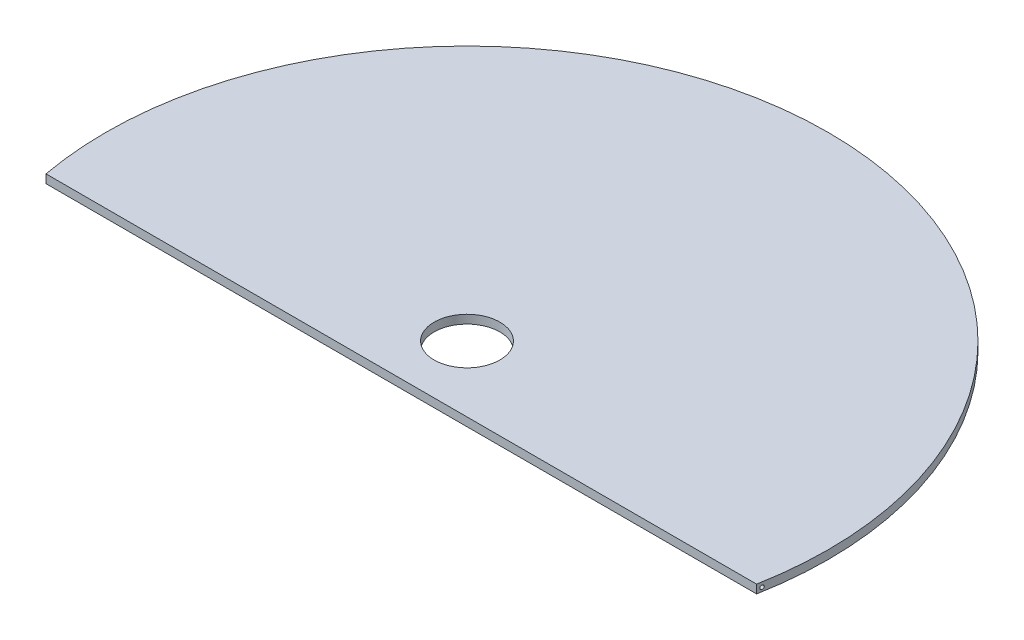
ISO-10303-21;
HEADER;
FILE_DESCRIPTION(('STEP AP214'),'2;1');
FILE_NAME('part.step','',(''),(''),'','','');
FILE_SCHEMA(('AUTOMOTIVE_DESIGN { 1 0 10303 214 1 1 1 1 }'));
ENDSEC;
DATA;
#1=APPLICATION_CONTEXT('core data for automotive mechanical design processes');
#2=APPLICATION_PROTOCOL_DEFINITION('international standard','automotive_design',2000,#1);
#3=PRODUCT_CONTEXT('',#1,'mechanical');
#4=PRODUCT('Part','Part','',(#3));
#5=PRODUCT_RELATED_PRODUCT_CATEGORY('part','',(#4));
#6=PRODUCT_DEFINITION_FORMATION('','',#4);
#7=PRODUCT_DEFINITION_CONTEXT('part definition',#1,'design');
#8=PRODUCT_DEFINITION('design','',#6,#7);
#9=PRODUCT_DEFINITION_SHAPE('','',#8);
#10=(LENGTH_UNIT() NAMED_UNIT(*) SI_UNIT(.MILLI.,.METRE.));
#11=(NAMED_UNIT(*) PLANE_ANGLE_UNIT() SI_UNIT($,.RADIAN.));
#12=(NAMED_UNIT(*) SI_UNIT($,.STERADIAN.) SOLID_ANGLE_UNIT());
#13=UNCERTAINTY_MEASURE_WITH_UNIT(LENGTH_MEASURE(1.E-05),#10,'distance_accuracy_value','');
#14=(GEOMETRIC_REPRESENTATION_CONTEXT(3) GLOBAL_UNCERTAINTY_ASSIGNED_CONTEXT((#13)) GLOBAL_UNIT_ASSIGNED_CONTEXT((#10,
#11,#12)) REPRESENTATION_CONTEXT('',''));
#15=CARTESIAN_POINT('',(0.,0.,0.));
#16=DIRECTION('',(0.,0.,1.));
#17=DIRECTION('',(1.,0.,0.));
#18=AXIS2_PLACEMENT_3D('',#15,#16,#17);
#19=CARTESIAN_POINT('',(0.,3.302,25.4));
#20=DIRECTION('',(0.,0.,-1.));
#21=DIRECTION('',(-1.,0.,0.));
#22=AXIS2_PLACEMENT_3D('',#19,#20,#21);
#23=PLANE('',#22);
#24=DIRECTION('',(1.,0.,0.));
#25=VECTOR('',#24,1.);
#26=CARTESIAN_POINT('',(0.,0.,25.4));
#27=LINE('',#26,#25);
#28=CARTESIAN_POINT('',(-137.371503595178,0.,25.4));
#29=VERTEX_POINT('',#28);
#30=CARTESIAN_POINT('',(137.371503595178,0.,25.4));
#31=VERTEX_POINT('',#30);
#32=EDGE_CURVE('E73',#29,#31,#27,.T.);
#33=ORIENTED_EDGE('',*,*,#32,.T.);
#34=DIRECTION('',(0.,-1.,0.));
#35=VECTOR('',#34,1.);
#36=CARTESIAN_POINT('',(137.371503595178,3.302,25.4));
#37=LINE('',#36,#35);
#38=CARTESIAN_POINT('',(137.371503595178,3.302,25.4));
#39=VERTEX_POINT('',#38);
#40=EDGE_CURVE('E11',#39,#31,#37,.T.);
#41=ORIENTED_EDGE('',*,*,#40,.F.);
#42=DIRECTION('',(1.,0.,0.));
#43=VECTOR('',#42,1.);
#44=CARTESIAN_POINT('',(0.,3.302,25.4));
#45=LINE('',#44,#43);
#46=CARTESIAN_POINT('',(-137.371503595178,3.302,25.4));
#47=VERTEX_POINT('',#46);
#48=EDGE_CURVE('E76',#47,#39,#45,.T.);
#49=ORIENTED_EDGE('',*,*,#48,.F.);
#50=DIRECTION('',(0.,-1.,0.));
#51=VECTOR('',#50,1.);
#52=CARTESIAN_POINT('',(-137.371503595178,3.302,25.4));
#53=LINE('',#52,#51);
#54=EDGE_CURVE('E49',#47,#29,#53,.T.);
#55=ORIENTED_EDGE('',*,*,#54,.T.);
#56=EDGE_LOOP('',(#33,#41,#49,#55));
#57=FACE_BOUND('',#56,.T.);
#58=ADVANCED_FACE('F35',(#57),#23,.F.);
#59=CARTESIAN_POINT('',(0.,3.302,0.));
#60=DIRECTION('',(0.,-1.,0.));
#61=DIRECTION('',(0.,0.,-1.));
#62=AXIS2_PLACEMENT_3D('',#59,#60,#61);
#63=CYLINDRICAL_SURFACE('',#62,12.7);
#64=CARTESIAN_POINT('',(0.,3.302,0.));
#65=DIRECTION('',(0.,1.,0.));
#66=DIRECTION('',(0.,0.,1.));
#67=AXIS2_PLACEMENT_3D('',#64,#65,#66);
#68=CIRCLE('',#67,12.7);
#69=CARTESIAN_POINT('',(0.,3.302,12.7));
#70=VERTEX_POINT('',#69);
#71=EDGE_CURVE('E72',#70,#70,#68,.T.);
#72=ORIENTED_EDGE('',*,*,#71,.T.);
#73=EDGE_LOOP('',(#72));
#74=FACE_BOUND('',#73,.T.);
#75=CARTESIAN_POINT('',(0.,0.,0.));
#76=DIRECTION('',(0.,1.,0.));
#77=DIRECTION('',(0.,0.,1.));
#78=AXIS2_PLACEMENT_3D('',#75,#76,#77);
#79=CIRCLE('',#78,12.7);
#80=CARTESIAN_POINT('',(0.,0.,12.7));
#81=VERTEX_POINT('',#80);
#82=EDGE_CURVE('E79',#81,#81,#79,.T.);
#83=ORIENTED_EDGE('',*,*,#82,.F.);
#84=EDGE_LOOP('',(#83));
#85=FACE_BOUND('',#84,.T.);
#86=ADVANCED_FACE('F37',(#74,#85),#63,.F.);
#87=CARTESIAN_POINT('',(0.,3.302,0.));
#88=DIRECTION('',(0.,-1.,0.));
#89=DIRECTION('',(0.,0.,-1.));
#90=AXIS2_PLACEMENT_3D('',#87,#88,#89);
#91=CYLINDRICAL_SURFACE('',#90,139.7);
#92=CARTESIAN_POINT('',(-137.814088901934,1.524,22.8772135569419));
#93=CARTESIAN_POINT('',(-137.814088602734,1.56541229015592,22.877215461518));
#94=CARTESIAN_POINT('',(-137.813513624116,1.60685489980099,22.8806799107889));
#95=CARTESIAN_POINT('',(-137.811227744358,1.68859140060342,22.8944437436117));
#96=CARTESIAN_POINT('',(-137.809515470055,1.72888384164274,22.9047513895882));
#97=CARTESIAN_POINT('',(-137.805003605925,1.80711612692118,22.9318810621751));
#98=CARTESIAN_POINT('',(-137.802204838894,1.8450577262873,22.9486981591839));
#99=CARTESIAN_POINT('',(-137.795597988017,1.91755182448106,22.9883356695262));
#100=CARTESIAN_POINT('',(-137.791790131559,1.95210508443472,23.0111547303722));
#101=CARTESIAN_POINT('',(-137.78324312594,2.01708744886675,23.0622762806492));
#102=CARTESIAN_POINT('',(-137.778498597835,2.04749093175989,23.0906104272114));
#103=CARTESIAN_POINT('',(-137.768221093349,2.10311892189644,23.1518513090451));
#104=CARTESIAN_POINT('',(-137.762688040892,2.12834292885472,23.1847584855107));
#105=CARTESIAN_POINT('',(-137.750906121703,2.17324133938305,23.2546583041101));
#106=CARTESIAN_POINT('',(-137.744648985501,2.19284042872746,23.2916979254072));
#107=CARTESIAN_POINT('',(-137.731646895851,2.22554517001531,23.368460748667));
#108=CARTESIAN_POINT('',(-137.724901907864,2.23865036169288,23.4081841406197));
#109=CARTESIAN_POINT('',(-137.711017517757,2.25816011384876,23.4897293567195));
#110=CARTESIAN_POINT('',(-137.703874181362,2.2644770482989,23.5315714879941));
#111=CARTESIAN_POINT('',(-137.689470999952,2.2699520390152,23.6157023445996));
#112=CARTESIAN_POINT('',(-137.682211149111,2.26910973607268,23.6579910922328));
#113=CARTESIAN_POINT('',(-137.66772542279,2.26025806070488,23.7421400251758));
#114=CARTESIAN_POINT('',(-137.6605001795,2.25219655218458,23.7839948486633));
#115=CARTESIAN_POINT('',(-137.646346992319,2.22904588615588,23.8657680081781));
#116=CARTESIAN_POINT('',(-137.639419050781,2.21395667303788,23.9056863288792));
#117=CARTESIAN_POINT('',(-137.626078917368,2.17718256455738,23.9823667568922));
#118=CARTESIAN_POINT('',(-137.619665839752,2.15550931731716,24.019134292305));
#119=CARTESIAN_POINT('',(-137.607539727578,2.10614143192906,24.088508713765));
#120=CARTESIAN_POINT('',(-137.601826658777,2.07844708850326,24.1211158033349));
#121=CARTESIAN_POINT('',(-137.59133934309,2.0181249917138,24.1808653767689));
#122=CARTESIAN_POINT('',(-137.586555816136,1.98555244499801,24.2080619493794));
#123=CARTESIAN_POINT('',(-137.578009595423,1.91617466076484,24.2565843597577));
#124=CARTESIAN_POINT('',(-137.574246815699,1.87936978006087,24.2779106919114));
#125=CARTESIAN_POINT('',(-137.567916485798,1.80315758837691,24.3137549905397));
#126=CARTESIAN_POINT('',(-137.565332051123,1.76379692086494,24.3283691595061));
#127=CARTESIAN_POINT('',(-137.561364648943,1.683125244701,24.3507923258079));
#128=CARTESIAN_POINT('',(-137.559981587903,1.64181438814802,24.3586018529292));
#129=CARTESIAN_POINT('',(-137.558473507958,1.55895093085115,24.3671168761356));
#130=CARTESIAN_POINT('',(-137.558333480365,1.51740729225714,24.3679071247684));
#131=CARTESIAN_POINT('',(-137.559276849337,1.43478027041791,24.3625811395361));
#132=CARTESIAN_POINT('',(-137.560360204681,1.39369687171163,24.356465138383));
#133=CARTESIAN_POINT('',(-137.563707724896,1.31330537955675,24.3375513923011));
#134=CARTESIAN_POINT('',(-137.565967660873,1.27399147237238,24.3247775768755));
#135=CARTESIAN_POINT('',(-137.571591359621,1.19807901894383,24.292951866678));
#136=CARTESIAN_POINT('',(-137.57495514671,1.16148053254033,24.2738998336012));
#137=CARTESIAN_POINT('',(-137.582703945973,1.09176995437964,24.2299416908682));
#138=CARTESIAN_POINT('',(-137.587095494618,1.05868223524135,24.2049981016421));
#139=CARTESIAN_POINT('',(-137.596749550455,0.99715735316511,24.1500577478816));
#140=CARTESIAN_POINT('',(-137.602012114107,0.968720491941779,24.1200606557679));
#141=CARTESIAN_POINT('',(-137.613324691219,0.91689255789136,24.0554350579893));
#142=CARTESIAN_POINT('',(-137.619384350884,0.89357455835839,24.0207496448089));
#143=CARTESIAN_POINT('',(-137.632053506769,0.853083993332087,23.9480522715928));
#144=CARTESIAN_POINT('',(-137.638663045093,0.835911898975186,23.910040056807));
#145=CARTESIAN_POINT('',(-137.65233789263,0.807954011711257,23.831187440786));
#146=CARTESIAN_POINT('',(-137.659408337526,0.797262276720684,23.790314567025));
#147=CARTESIAN_POINT('',(-137.673715626853,0.782927380034137,23.7073785139701));
#148=CARTESIAN_POINT('',(-137.680952481235,0.779284640936794,23.6653152634646));
#149=CARTESIAN_POINT('',(-137.695451921803,0.779143938828642,23.5808051929691));
#150=CARTESIAN_POINT('',(-137.702714190048,0.782707981171509,23.5383581990655));
#151=CARTESIAN_POINT('',(-137.716996909315,0.7970174999458,23.4546491312152));
#152=CARTESIAN_POINT('',(-137.724017357027,0.807763074628672,23.4133870734879));
#153=CARTESIAN_POINT('',(-137.737616638179,0.836150471807186,23.3332512729245));
#154=CARTESIAN_POINT('',(-137.744195683889,0.853788951236724,23.2943763828699));
#155=CARTESIAN_POINT('',(-137.756730878267,0.895492855772405,23.2201317129295));
#156=CARTESIAN_POINT('',(-137.762687075876,0.919557775387351,23.1847616576602));
#157=CARTESIAN_POINT('',(-137.773756913172,0.9732063034733,23.1188886727763));
#158=CARTESIAN_POINT('',(-137.77887780573,1.00273705864569,23.0883439278526));
#159=CARTESIAN_POINT('',(-137.788199374711,1.06665058313756,23.03264884366));
#160=CARTESIAN_POINT('',(-137.792399885308,1.10103422496606,23.0074994764891));
#161=CARTESIAN_POINT('',(-137.79971082787,1.17318764050581,22.9636709751561));
#162=CARTESIAN_POINT('',(-137.802834691528,1.21090771209475,22.9449121527964));
#163=CARTESIAN_POINT('',(-137.807975548275,1.28900196966712,22.9140158653081));
#164=CARTESIAN_POINT('',(-137.809993984473,1.32937261786433,22.9018697675494));
#165=CARTESIAN_POINT('',(-137.81231517964,1.39568343160024,22.8878966161835));
#166=CARTESIAN_POINT('',(-137.812979500056,1.4211734696311,22.883895838532));
#167=CARTESIAN_POINT('',(-137.813866452795,1.47243842117016,22.8785537253401));
#168=CARTESIAN_POINT('',(-137.81408908824,1.49821333266302,22.8772123709976));
#169=CARTESIAN_POINT('',(-137.814088901934,1.524,22.8772135569419));
#170=B_SPLINE_CURVE_WITH_KNOTS('',3,(#92,#93,#94,#95,#96,#97,#98,#99,#100,#101,#102,#103,#104,
#105,#106,#107,#108,#109,#110,#111,#112,#113,#114,#115,#116,#117,#118,#119,#120,#121,#122,#123,
#124,#125,#126,#127,#128,#129,#130,#131,#132,#133,#134,#135,#136,#137,#138,#139,#140,#141,#142,
#143,#144,#145,#146,#147,#148,#149,#150,#151,#152,#153,#154,#155,#156,#157,#158,#159,#160,#161,
#162,#163,#164,#165,#166,#167,#168,#169),.UNSPECIFIED.,.T.,.F.,(4,2,2,2,2,2,2,2,2,2,2,2,2,2,2,2,
2,2,2,2,2,2,2,2,2,2,2,2,2,2,2,2,2,2,2,2,2,2,4),(0.,0.124142082302337,0.248434326084497,
0.372632627036189,0.496802964984026,0.621708271289402,0.746625636518215,0.873144899670392,
0.999673128804814,1.12781571818462,1.25596473704859,1.38504676082984,1.51412980604299,
1.6429858013636,1.77183549082915,1.89932402456649,2.02680181805616,2.15239066998675,
2.27796974313224,2.40203045058428,2.52608697783001,2.64970066514507,2.77331707576997,
2.89774213169813,3.02217525624102,3.14828335835745,3.27440112567372,3.40230811132794,
3.53022276497396,3.65924264664658,3.78826429349259,3.91722344221016,4.04617245023996,
4.1739341647369,4.30171887906741,4.42784622730688,4.55380852442893,4.63111005012408,
4.7084110292971),.UNSPECIFIED.);
#171=CARTESIAN_POINT('',(-137.814088901934,1.524,22.8772135569419));
#172=VERTEX_POINT('',#171);
#173=EDGE_CURVE('E39',#172,#172,#170,.T.);
#174=ORIENTED_EDGE('',*,*,#173,.T.);
#175=EDGE_LOOP('',(#174));
#176=FACE_BOUND('',#175,.T.);
#177=CARTESIAN_POINT('',(137.814088901934,1.524,22.8772135569419));
#178=CARTESIAN_POINT('',(137.814088602734,1.48258770984408,22.877215461518));
#179=CARTESIAN_POINT('',(137.813513624116,1.44114510019901,22.8806799107889));
#180=CARTESIAN_POINT('',(137.811227744358,1.35940859939658,22.8944437436117));
#181=CARTESIAN_POINT('',(137.809515470055,1.31911615835725,22.9047513895882));
#182=CARTESIAN_POINT('',(137.805003605925,1.24088387307882,22.9318810621751));
#183=CARTESIAN_POINT('',(137.802204838894,1.2029422737127,22.9486981591839));
#184=CARTESIAN_POINT('',(137.795597988017,1.13044817551894,22.9883356695262));
#185=CARTESIAN_POINT('',(137.791790131559,1.09589491556528,23.0111547303722));
#186=CARTESIAN_POINT('',(137.78324312594,1.03091255113325,23.0622762806492));
#187=CARTESIAN_POINT('',(137.778498597835,1.00050906824011,23.0906104272114));
#188=CARTESIAN_POINT('',(137.768221093349,0.94488107810356,23.1518513090451));
#189=CARTESIAN_POINT('',(137.762688040892,0.919657071145279,23.1847584855107));
#190=CARTESIAN_POINT('',(137.750906121703,0.874758660616954,23.2546583041101));
#191=CARTESIAN_POINT('',(137.744648985501,0.855159571272535,23.2916979254072));
#192=CARTESIAN_POINT('',(137.731646895851,0.822454829984689,23.368460748667));
#193=CARTESIAN_POINT('',(137.724901907864,0.809349638307121,23.4081841406197));
#194=CARTESIAN_POINT('',(137.711017517757,0.789839886151243,23.4897293567195));
#195=CARTESIAN_POINT('',(137.703874181362,0.783522951701104,23.5315714879941));
#196=CARTESIAN_POINT('',(137.689470999952,0.778047960984795,23.6157023445996));
#197=CARTESIAN_POINT('',(137.682211149111,0.778890263927314,23.6579910922328));
#198=CARTESIAN_POINT('',(137.66772542279,0.787741939295116,23.7421400251758));
#199=CARTESIAN_POINT('',(137.6605001795,0.795803447815424,23.7839948486633));
#200=CARTESIAN_POINT('',(137.646346992319,0.818954113844124,23.8657680081781));
#201=CARTESIAN_POINT('',(137.639419050781,0.834043326962116,23.9056863288792));
#202=CARTESIAN_POINT('',(137.626078917368,0.870817435442617,23.9823667568922));
#203=CARTESIAN_POINT('',(137.619665839752,0.89249068268284,24.019134292305));
#204=CARTESIAN_POINT('',(137.607539727578,0.941858568070943,24.088508713765));
#205=CARTESIAN_POINT('',(137.601826658777,0.969552911496744,24.1211158033349));
#206=CARTESIAN_POINT('',(137.59133934309,1.0298750082862,24.1808653767689));
#207=CARTESIAN_POINT('',(137.586555816136,1.06244755500199,24.2080619493794));
#208=CARTESIAN_POINT('',(137.578009595423,1.13182533923516,24.2565843597577));
#209=CARTESIAN_POINT('',(137.574246815699,1.16863021993913,24.2779106919114));
#210=CARTESIAN_POINT('',(137.567916485798,1.24484241162309,24.3137549905397));
#211=CARTESIAN_POINT('',(137.565332051123,1.28420307913506,24.3283691595061));
#212=CARTESIAN_POINT('',(137.561364648943,1.364874755299,24.3507923258079));
#213=CARTESIAN_POINT('',(137.559981587903,1.40618561185198,24.3586018529292));
#214=CARTESIAN_POINT('',(137.558473507958,1.48904906914885,24.3671168761356));
#215=CARTESIAN_POINT('',(137.558333480365,1.53059270774286,24.3679071247684));
#216=CARTESIAN_POINT('',(137.559276849337,1.61321972958209,24.3625811395361));
#217=CARTESIAN_POINT('',(137.560360204681,1.65430312828837,24.356465138383));
#218=CARTESIAN_POINT('',(137.563707724896,1.73469462044325,24.3375513923011));
#219=CARTESIAN_POINT('',(137.565967660873,1.77400852762762,24.3247775768755));
#220=CARTESIAN_POINT('',(137.571591359621,1.84992098105617,24.292951866678));
#221=CARTESIAN_POINT('',(137.57495514671,1.88651946745967,24.2738998336012));
#222=CARTESIAN_POINT('',(137.582703945973,1.95623004562036,24.2299416908682));
#223=CARTESIAN_POINT('',(137.587095494618,1.98931776475865,24.2049981016421));
#224=CARTESIAN_POINT('',(137.596749550455,2.05084264683489,24.1500577478816));
#225=CARTESIAN_POINT('',(137.602012114107,2.07927950805822,24.1200606557679));
#226=CARTESIAN_POINT('',(137.613324691219,2.13110744210864,24.0554350579893));
#227=CARTESIAN_POINT('',(137.619384350884,2.15442544164161,24.0207496448089));
#228=CARTESIAN_POINT('',(137.632053506769,2.19491600666791,23.9480522715928));
#229=CARTESIAN_POINT('',(137.638663045093,2.21208810102481,23.910040056807));
#230=CARTESIAN_POINT('',(137.65233789263,2.24004598828874,23.831187440786));
#231=CARTESIAN_POINT('',(137.659408337526,2.25073772327932,23.790314567025));
#232=CARTESIAN_POINT('',(137.673715626853,2.26507261996586,23.7073785139701));
#233=CARTESIAN_POINT('',(137.680952481235,2.26871535906321,23.6653152634646));
#234=CARTESIAN_POINT('',(137.695451921803,2.26885606117136,23.5808051929691));
#235=CARTESIAN_POINT('',(137.702714190048,2.26529201882849,23.5383581990655));
#236=CARTESIAN_POINT('',(137.716996909315,2.2509825000542,23.4546491312152));
#237=CARTESIAN_POINT('',(137.724017357027,2.24023692537133,23.4133870734879));
#238=CARTESIAN_POINT('',(137.737616638179,2.21184952819281,23.3332512729245));
#239=CARTESIAN_POINT('',(137.744195683889,2.19421104876328,23.2943763828699));
#240=CARTESIAN_POINT('',(137.756730878267,2.15250714422759,23.2201317129295));
#241=CARTESIAN_POINT('',(137.762687075876,2.12844222461265,23.1847616576602));
#242=CARTESIAN_POINT('',(137.773756913172,2.0747936965267,23.1188886727763));
#243=CARTESIAN_POINT('',(137.77887780573,2.04526294135431,23.0883439278526));
#244=CARTESIAN_POINT('',(137.788199374711,1.98134941686244,23.0326488436601));
#245=CARTESIAN_POINT('',(137.792399885308,1.94696577503395,23.0074994764891));
#246=CARTESIAN_POINT('',(137.79971082787,1.87481235949419,22.9636709751561));
#247=CARTESIAN_POINT('',(137.802834691528,1.83709228790525,22.9449121527964));
#248=CARTESIAN_POINT('',(137.807975548275,1.75899803033288,22.9140158653081));
#249=CARTESIAN_POINT('',(137.809993984473,1.71862738213567,22.9018697675494));
#250=CARTESIAN_POINT('',(137.81231517964,1.65231656839976,22.8878966161835));
#251=CARTESIAN_POINT('',(137.812979500056,1.6268265303689,22.883895838532));
#252=CARTESIAN_POINT('',(137.813866452795,1.57556157882984,22.8785537253401));
#253=CARTESIAN_POINT('',(137.81408908824,1.54978666733698,22.8772123709976));
#254=CARTESIAN_POINT('',(137.814088901934,1.524,22.8772135569419));
#255=B_SPLINE_CURVE_WITH_KNOTS('',3,(#177,#178,#179,#180,#181,#182,#183,#184,#185,#186,#187,
#188,#189,#190,#191,#192,#193,#194,#195,#196,#197,#198,#199,#200,#201,#202,#203,#204,#205,#206,
#207,#208,#209,#210,#211,#212,#213,#214,#215,#216,#217,#218,#219,#220,#221,#222,#223,#224,#225,
#226,#227,#228,#229,#230,#231,#232,#233,#234,#235,#236,#237,#238,#239,#240,#241,#242,#243,#244,
#245,#246,#247,#248,#249,#250,#251,#252,#253,#254),.UNSPECIFIED.,.T.,.F.,(4,2,2,2,2,2,2,2,2,2,2,
2,2,2,2,2,2,2,2,2,2,2,2,2,2,2,2,2,2,2,2,2,2,2,2,2,2,2,4),(0.,0.124142082302338,
0.248434326084498,0.37263262703619,0.496802964984027,0.621708271289403,0.746625636518216,
0.873144899670393,0.999673128804815,1.12781571818462,1.25596473704859,1.38504676082984,
1.51412980604299,1.6429858013636,1.77183549082915,1.89932402456649,2.02680181805616,
2.15239066998675,2.27796974313224,2.40203045058428,2.52608697783001,2.64970066514508,
2.77331707576997,2.89774213169813,3.02217525624101,3.14828335835744,3.27440112567372,
3.40230811132794,3.53022276497396,3.65924264664658,3.78826429349259,3.91722344221016,
4.04617245023996,4.17393416473689,4.30171887906741,4.42784622730688,4.55380852442894,
4.63111005012408,4.7084110292971),.UNSPECIFIED.);
#256=CARTESIAN_POINT('',(137.814088901934,1.524,22.8772135569419));
#257=VERTEX_POINT('',#256);
#258=EDGE_CURVE('E84',#257,#257,#255,.T.);
#259=ORIENTED_EDGE('',*,*,#258,.T.);
#260=EDGE_LOOP('',(#259));
#261=FACE_BOUND('',#260,.T.);
#262=CARTESIAN_POINT('',(0.,0.,0.));
#263=DIRECTION('',(0.,1.,0.));
#264=DIRECTION('',(0.,0.,1.));
#265=AXIS2_PLACEMENT_3D('',#262,#263,#264);
#266=CIRCLE('',#265,139.7);
#267=EDGE_CURVE('E65',#31,#29,#266,.T.);
#268=ORIENTED_EDGE('',*,*,#267,.T.);
#269=ORIENTED_EDGE('',*,*,#54,.F.);
#270=CARTESIAN_POINT('',(0.,3.302,0.));
#271=DIRECTION('',(0.,1.,0.));
#272=DIRECTION('',(0.,0.,1.));
#273=AXIS2_PLACEMENT_3D('',#270,#271,#272);
#274=CIRCLE('',#273,139.7);
#275=EDGE_CURVE('E57',#39,#47,#274,.T.);
#276=ORIENTED_EDGE('',*,*,#275,.F.);
#277=ORIENTED_EDGE('',*,*,#40,.T.);
#278=EDGE_LOOP('',(#268,#269,#276,#277));
#279=FACE_BOUND('',#278,.T.);
#280=ADVANCED_FACE('F68',(#176,#261,#279),#91,.T.);
#281=CARTESIAN_POINT('',(0.,3.302,0.));
#282=DIRECTION('',(0.,1.,0.));
#283=DIRECTION('',(0.,0.,1.));
#284=AXIS2_PLACEMENT_3D('',#281,#282,#283);
#285=PLANE('',#284);
#286=ORIENTED_EDGE('',*,*,#71,.F.);
#287=EDGE_LOOP('',(#286));
#288=FACE_BOUND('',#287,.T.);
#289=ORIENTED_EDGE('',*,*,#48,.T.);
#290=ORIENTED_EDGE('',*,*,#275,.T.);
#291=EDGE_LOOP('',(#289,#290));
#292=FACE_BOUND('',#291,.T.);
#293=ADVANCED_FACE('F95',(#288,#292),#285,.T.);
#294=CARTESIAN_POINT('',(0.,0.,0.));
#295=DIRECTION('',(0.,1.,0.));
#296=DIRECTION('',(0.,0.,1.));
#297=AXIS2_PLACEMENT_3D('',#294,#295,#296);
#298=PLANE('',#297);
#299=ORIENTED_EDGE('',*,*,#82,.T.);
#300=EDGE_LOOP('',(#299));
#301=FACE_BOUND('',#300,.T.);
#302=ORIENTED_EDGE('',*,*,#32,.F.);
#303=ORIENTED_EDGE('',*,*,#267,.F.);
#304=EDGE_LOOP('',(#302,#303));
#305=FACE_BOUND('',#304,.T.);
#306=ADVANCED_FACE('F78',(#301,#305),#298,.F.);
#307=CARTESIAN_POINT('',(-139.7,1.524,23.622));
#308=DIRECTION('',(1.,0.,0.));
#309=DIRECTION('',(0.,0.,-1.));
#310=AXIS2_PLACEMENT_3D('',#307,#308,#309);
#311=CYLINDRICAL_SURFACE('',#310,0.744786443058064);
#312=ORIENTED_EDGE('',*,*,#258,.F.);
#313=EDGE_LOOP('',(#312));
#314=FACE_BOUND('',#313,.T.);
#315=ORIENTED_EDGE('',*,*,#173,.F.);
#316=EDGE_LOOP('',(#315));
#317=FACE_BOUND('',#316,.T.);
#318=ADVANCED_FACE('F90',(#314,#317),#311,.F.);
#319=CLOSED_SHELL('',(#58,#86,#280,#293,#306,#318));
#320=MANIFOLD_SOLID_BREP('B2',#319);
#321=ADVANCED_BREP_SHAPE_REPRESENTATION('',(#18,#320),#14);
#322=SHAPE_DEFINITION_REPRESENTATION(#9,#321);
ENDSEC;
END-ISO-10303-21;
